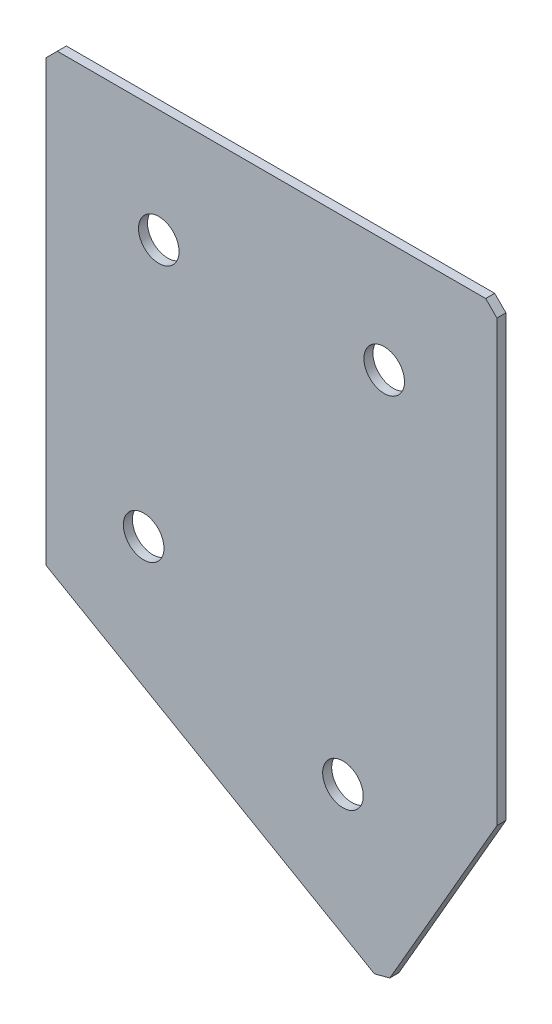
ISO-10303-21;
HEADER;
FILE_DESCRIPTION(('STEP AP214'),'2;1');
FILE_NAME('part.step','',(''),(''),'','','');
FILE_SCHEMA(('AUTOMOTIVE_DESIGN { 1 0 10303 214 1 1 1 1 }'));
ENDSEC;
DATA;
#1=APPLICATION_CONTEXT('core data for automotive mechanical design processes');
#2=APPLICATION_PROTOCOL_DEFINITION('international standard','automotive_design',2000,#1);
#3=PRODUCT_CONTEXT('',#1,'mechanical');
#4=PRODUCT('Part','Part','',(#3));
#5=PRODUCT_RELATED_PRODUCT_CATEGORY('part','',(#4));
#6=PRODUCT_DEFINITION_FORMATION('','',#4);
#7=PRODUCT_DEFINITION_CONTEXT('part definition',#1,'design');
#8=PRODUCT_DEFINITION('design','',#6,#7);
#9=PRODUCT_DEFINITION_SHAPE('','',#8);
#10=(LENGTH_UNIT() NAMED_UNIT(*) SI_UNIT(.MILLI.,.METRE.));
#11=(NAMED_UNIT(*) PLANE_ANGLE_UNIT() SI_UNIT($,.RADIAN.));
#12=(NAMED_UNIT(*) SI_UNIT($,.STERADIAN.) SOLID_ANGLE_UNIT());
#13=UNCERTAINTY_MEASURE_WITH_UNIT(LENGTH_MEASURE(1.E-05),#10,'distance_accuracy_value','');
#14=(GEOMETRIC_REPRESENTATION_CONTEXT(3) GLOBAL_UNCERTAINTY_ASSIGNED_CONTEXT((#13)) GLOBAL_UNIT_ASSIGNED_CONTEXT((#10,
#11,#12)) REPRESENTATION_CONTEXT('',''));
#15=CARTESIAN_POINT('',(0.,0.,0.));
#16=DIRECTION('',(0.,0.,1.));
#17=DIRECTION('',(1.,0.,0.));
#18=AXIS2_PLACEMENT_3D('',#15,#16,#17);
#19=CARTESIAN_POINT('',(0.,0.,-2.));
#20=DIRECTION('',(1.,0.,0.));
#21=DIRECTION('',(0.,0.,-1.));
#22=AXIS2_PLACEMENT_3D('',#19,#20,#21);
#23=PLANE('',#22);
#24=DIRECTION('',(0.,1.,0.));
#25=VECTOR('',#24,1.);
#26=CARTESIAN_POINT('',(0.,0.,0.));
#27=LINE('',#26,#25);
#28=CARTESIAN_POINT('',(0.,-100.,0.));
#29=VERTEX_POINT('',#28);
#30=CARTESIAN_POINT('',(0.,-2.49999999999999,0.));
#31=VERTEX_POINT('',#30);
#32=EDGE_CURVE('E137',#29,#31,#27,.T.);
#33=ORIENTED_EDGE('',*,*,#32,.T.);
#34=DIRECTION('',(0.,0.,-1.));
#35=VECTOR('',#34,1.);
#36=CARTESIAN_POINT('',(0.,-2.49999999999999,-2.));
#37=LINE('',#36,#35);
#38=CARTESIAN_POINT('',(0.,-2.49999999999999,-2.));
#39=VERTEX_POINT('',#38);
#40=EDGE_CURVE('E11',#31,#39,#37,.T.);
#41=ORIENTED_EDGE('',*,*,#40,.T.);
#42=DIRECTION('',(0.,1.,0.));
#43=VECTOR('',#42,1.);
#44=CARTESIAN_POINT('',(0.,0.,-2.));
#45=LINE('',#44,#43);
#46=CARTESIAN_POINT('',(0.,-100.,-2.));
#47=VERTEX_POINT('',#46);
#48=EDGE_CURVE('E153',#47,#39,#45,.T.);
#49=ORIENTED_EDGE('',*,*,#48,.F.);
#50=DIRECTION('',(0.,0.,1.));
#51=VECTOR('',#50,1.);
#52=CARTESIAN_POINT('',(0.,-100.,-2.));
#53=LINE('',#52,#51);
#54=EDGE_CURVE('E125',#47,#29,#53,.T.);
#55=ORIENTED_EDGE('',*,*,#54,.T.);
#56=EDGE_LOOP('',(#33,#41,#49,#55));
#57=FACE_BOUND('',#56,.T.);
#58=ADVANCED_FACE('F39',(#57),#23,.F.);
#59=CARTESIAN_POINT('',(0.,0.,-2.));
#60=DIRECTION('',(0.,-1.,0.));
#61=DIRECTION('',(0.,0.,-1.));
#62=AXIS2_PLACEMENT_3D('',#59,#60,#61);
#63=PLANE('',#62);
#64=DIRECTION('',(1.,0.,0.));
#65=VECTOR('',#64,1.);
#66=CARTESIAN_POINT('',(0.,0.,0.));
#67=LINE('',#66,#65);
#68=CARTESIAN_POINT('',(2.49999999999999,0.,0.));
#69=VERTEX_POINT('',#68);
#70=CARTESIAN_POINT('',(97.5,0.,0.));
#71=VERTEX_POINT('',#70);
#72=EDGE_CURVE('E141',#69,#71,#67,.T.);
#73=ORIENTED_EDGE('',*,*,#72,.T.);
#74=DIRECTION('',(0.,0.,-1.));
#75=VECTOR('',#74,1.);
#76=CARTESIAN_POINT('',(97.5,0.,-2.));
#77=LINE('',#76,#75);
#78=CARTESIAN_POINT('',(97.5,0.,-2.));
#79=VERTEX_POINT('',#78);
#80=EDGE_CURVE('E48',#71,#79,#77,.T.);
#81=ORIENTED_EDGE('',*,*,#80,.T.);
#82=DIRECTION('',(1.,0.,0.));
#83=VECTOR('',#82,1.);
#84=CARTESIAN_POINT('',(0.,0.,-2.));
#85=LINE('',#84,#83);
#86=CARTESIAN_POINT('',(2.49999999999999,0.,-2.));
#87=VERTEX_POINT('',#86);
#88=EDGE_CURVE('E113',#87,#79,#85,.T.);
#89=ORIENTED_EDGE('',*,*,#88,.F.);
#90=DIRECTION('',(0.,0.,1.));
#91=VECTOR('',#90,1.);
#92=CARTESIAN_POINT('',(2.49999999999999,0.,-2.));
#93=LINE('',#92,#91);
#94=EDGE_CURVE('E182',#87,#69,#93,.T.);
#95=ORIENTED_EDGE('',*,*,#94,.T.);
#96=EDGE_LOOP('',(#73,#81,#89,#95));
#97=FACE_BOUND('',#96,.T.);
#98=ADVANCED_FACE('F188',(#97),#63,.F.);
#99=CARTESIAN_POINT('',(100.,0.,-2.));
#100=DIRECTION('',(-1.,0.,0.));
#101=DIRECTION('',(0.,0.,1.));
#102=AXIS2_PLACEMENT_3D('',#99,#100,#101);
#103=PLANE('',#102);
#104=DIRECTION('',(0.,-1.,0.));
#105=VECTOR('',#104,1.);
#106=CARTESIAN_POINT('',(100.,0.,-2.));
#107=LINE('',#106,#105);
#108=CARTESIAN_POINT('',(100.,-2.50000000000004,-2.));
#109=VERTEX_POINT('',#108);
#110=CARTESIAN_POINT('',(100.,-100.,-2.));
#111=VERTEX_POINT('',#110);
#112=EDGE_CURVE('E103',#109,#111,#107,.T.);
#113=ORIENTED_EDGE('',*,*,#112,.F.);
#114=DIRECTION('',(0.,0.,1.));
#115=VECTOR('',#114,1.);
#116=CARTESIAN_POINT('',(100.,-2.50000000000004,-2.));
#117=LINE('',#116,#115);
#118=CARTESIAN_POINT('',(100.,-2.50000000000004,0.));
#119=VERTEX_POINT('',#118);
#120=EDGE_CURVE('E179',#109,#119,#117,.T.);
#121=ORIENTED_EDGE('',*,*,#120,.T.);
#122=DIRECTION('',(0.,-1.,0.));
#123=VECTOR('',#122,1.);
#124=CARTESIAN_POINT('',(100.,0.,0.));
#125=LINE('',#124,#123);
#126=CARTESIAN_POINT('',(100.,-100.,0.));
#127=VERTEX_POINT('',#126);
#128=EDGE_CURVE('E119',#119,#127,#125,.T.);
#129=ORIENTED_EDGE('',*,*,#128,.T.);
#130=DIRECTION('',(0.,0.,1.));
#131=VECTOR('',#130,1.);
#132=CARTESIAN_POINT('',(100.,-100.,-2.));
#133=LINE('',#132,#131);
#134=EDGE_CURVE('E116',#111,#127,#133,.T.);
#135=ORIENTED_EDGE('',*,*,#134,.F.);
#136=EDGE_LOOP('',(#113,#121,#129,#135));
#137=FACE_BOUND('',#136,.T.);
#138=ADVANCED_FACE('F117',(#137),#103,.F.);
#139=CARTESIAN_POINT('',(75.,-143.301270189222,-2.));
#140=DIRECTION('',(-0.866025403784438,0.500000000000001,0.));
#141=DIRECTION('',(-0.500000000000001,-0.866025403784438,0.));
#142=AXIS2_PLACEMENT_3D('',#139,#140,#141);
#143=PLANE('',#142);
#144=DIRECTION('',(-0.500000000000001,-0.866025403784438,0.));
#145=VECTOR('',#144,1.);
#146=CARTESIAN_POINT('',(75.,-143.301270189222,0.));
#147=LINE('',#146,#145);
#148=CARTESIAN_POINT('',(76.25,-141.136206679761,0.));
#149=VERTEX_POINT('',#148);
#150=EDGE_CURVE('E147',#127,#149,#147,.T.);
#151=ORIENTED_EDGE('',*,*,#150,.T.);
#152=DIRECTION('',(0.,0.,-1.));
#153=VECTOR('',#152,1.);
#154=CARTESIAN_POINT('',(76.25,-141.136206679761,-2.));
#155=LINE('',#154,#153);
#156=CARTESIAN_POINT('',(76.25,-141.136206679761,-2.));
#157=VERTEX_POINT('',#156);
#158=EDGE_CURVE('E129',#149,#157,#155,.T.);
#159=ORIENTED_EDGE('',*,*,#158,.T.);
#160=DIRECTION('',(-0.500000000000001,-0.866025403784438,0.));
#161=VECTOR('',#160,1.);
#162=CARTESIAN_POINT('',(75.,-143.301270189222,-2.));
#163=LINE('',#162,#161);
#164=EDGE_CURVE('E107',#111,#157,#163,.T.);
#165=ORIENTED_EDGE('',*,*,#164,.F.);
#166=ORIENTED_EDGE('',*,*,#134,.T.);
#167=EDGE_LOOP('',(#151,#159,#165,#166));
#168=FACE_BOUND('',#167,.T.);
#169=ADVANCED_FACE('F127',(#168),#143,.F.);
#170=CARTESIAN_POINT('',(0.,-100.,-2.));
#171=DIRECTION('',(0.500000000000001,0.866025403784438,0.));
#172=DIRECTION('',(-0.866025403784438,0.500000000000001,0.));
#173=AXIS2_PLACEMENT_3D('',#170,#171,#172);
#174=PLANE('',#173);
#175=DIRECTION('',(-0.866025403784438,0.500000000000001,0.));
#176=VECTOR('',#175,1.);
#177=CARTESIAN_POINT('',(0.,-100.,-2.));
#178=LINE('',#177,#176);
#179=CARTESIAN_POINT('',(72.8349364905389,-142.051270189222,-2.));
#180=VERTEX_POINT('',#179);
#181=EDGE_CURVE('E131',#180,#47,#178,.T.);
#182=ORIENTED_EDGE('',*,*,#181,.F.);
#183=DIRECTION('',(0.,0.,1.));
#184=VECTOR('',#183,1.);
#185=CARTESIAN_POINT('',(72.8349364905389,-142.051270189222,-2.));
#186=LINE('',#185,#184);
#187=CARTESIAN_POINT('',(72.8349364905389,-142.051270189222,0.));
#188=VERTEX_POINT('',#187);
#189=EDGE_CURVE('E124',#180,#188,#186,.T.);
#190=ORIENTED_EDGE('',*,*,#189,.T.);
#191=DIRECTION('',(-0.866025403784438,0.500000000000001,0.));
#192=VECTOR('',#191,1.);
#193=CARTESIAN_POINT('',(0.,-100.,0.));
#194=LINE('',#193,#192);
#195=EDGE_CURVE('E150',#188,#29,#194,.T.);
#196=ORIENTED_EDGE('',*,*,#195,.T.);
#197=ORIENTED_EDGE('',*,*,#54,.F.);
#198=EDGE_LOOP('',(#182,#190,#196,#197));
#199=FACE_BOUND('',#198,.T.);
#200=ADVANCED_FACE('F218',(#199),#174,.F.);
#201=CARTESIAN_POINT('',(0.,0.,-2.));
#202=DIRECTION('',(0.,0.,1.));
#203=DIRECTION('',(1.,0.,0.));
#204=AXIS2_PLACEMENT_3D('',#201,#202,#203);
#205=PLANE('',#204);
#206=CARTESIAN_POINT('',(25.,-25.,-2.));
#207=DIRECTION('',(0.,0.,-1.));
#208=DIRECTION('',(0.,1.,0.));
#209=AXIS2_PLACEMENT_3D('',#206,#207,#208);
#210=CIRCLE('',#209,4.5);
#211=CARTESIAN_POINT('',(25.,-20.5,-2.));
#212=VERTEX_POINT('',#211);
#213=EDGE_CURVE('E250',#212,#212,#210,.T.);
#214=ORIENTED_EDGE('',*,*,#213,.F.);
#215=EDGE_LOOP('',(#214));
#216=FACE_BOUND('',#215,.T.);
#217=CARTESIAN_POINT('',(75.,-25.,-2.));
#218=DIRECTION('',(0.,0.,-1.));
#219=DIRECTION('',(0.,1.,0.));
#220=AXIS2_PLACEMENT_3D('',#217,#218,#219);
#221=CIRCLE('',#220,4.5);
#222=CARTESIAN_POINT('',(75.,-20.5,-2.));
#223=VERTEX_POINT('',#222);
#224=EDGE_CURVE('E254',#223,#223,#221,.T.);
#225=ORIENTED_EDGE('',*,*,#224,.F.);
#226=EDGE_LOOP('',(#225));
#227=FACE_BOUND('',#226,.T.);
#228=CARTESIAN_POINT('',(21.650635094611,-83.6324865405189,-2.00000000000001));
#229=DIRECTION('',(0.,0.,-1.));
#230=DIRECTION('',(0.,1.,0.));
#231=AXIS2_PLACEMENT_3D('',#228,#229,#230);
#232=CIRCLE('',#231,4.5);
#233=CARTESIAN_POINT('',(21.650635094611,-79.1324865405189,-2.));
#234=VERTEX_POINT('',#233);
#235=EDGE_CURVE('E264',#234,#234,#232,.T.);
#236=ORIENTED_EDGE('',*,*,#235,.F.);
#237=EDGE_LOOP('',(#236));
#238=FACE_BOUND('',#237,.T.);
#239=CARTESIAN_POINT('',(65.8493649053891,-109.150635094611,-2.00000000000001));
#240=DIRECTION('',(0.,0.,-1.));
#241=DIRECTION('',(0.,1.,0.));
#242=AXIS2_PLACEMENT_3D('',#239,#240,#241);
#243=CIRCLE('',#242,4.5);
#244=CARTESIAN_POINT('',(65.8493649053891,-104.650635094611,-2.00000000000001));
#245=VERTEX_POINT('',#244);
#246=EDGE_CURVE('E272',#245,#245,#243,.T.);
#247=ORIENTED_EDGE('',*,*,#246,.F.);
#248=EDGE_LOOP('',(#247));
#249=FACE_BOUND('',#248,.T.);
#250=ORIENTED_EDGE('',*,*,#164,.T.);
#251=DIRECTION('',(0.965925826289068,0.258819045102523,0.));
#252=VECTOR('',#251,1.);
#253=CARTESIAN_POINT('',(72.8349364905389,-142.051270189222,-2.));
#254=LINE('',#253,#252);
#255=EDGE_CURVE('E176',#157,#180,#254,.F.);
#256=ORIENTED_EDGE('',*,*,#255,.T.);
#257=ORIENTED_EDGE('',*,*,#181,.T.);
#258=ORIENTED_EDGE('',*,*,#48,.T.);
#259=DIRECTION('',(-0.707106781186548,-0.707106781186548,0.));
#260=VECTOR('',#259,1.);
#261=CARTESIAN_POINT('',(2.49999999999999,0.,-2.));
#262=LINE('',#261,#260);
#263=EDGE_CURVE('E171',#39,#87,#262,.F.);
#264=ORIENTED_EDGE('',*,*,#263,.T.);
#265=ORIENTED_EDGE('',*,*,#88,.T.);
#266=DIRECTION('',(-0.707106781186546,0.70710678118655,0.));
#267=VECTOR('',#266,1.);
#268=CARTESIAN_POINT('',(100.,-2.50000000000004,-2.));
#269=LINE('',#268,#267);
#270=EDGE_CURVE('E55',#79,#109,#269,.F.);
#271=ORIENTED_EDGE('',*,*,#270,.T.);
#272=ORIENTED_EDGE('',*,*,#112,.T.);
#273=EDGE_LOOP('',(#250,#256,#257,#258,#264,#265,#271,#272));
#274=FACE_BOUND('',#273,.T.);
#275=ADVANCED_FACE('F105',(#216,#227,#238,#249,#274),#205,.F.);
#276=CARTESIAN_POINT('',(0.,0.,0.));
#277=DIRECTION('',(0.,0.,1.));
#278=DIRECTION('',(1.,0.,0.));
#279=AXIS2_PLACEMENT_3D('',#276,#277,#278);
#280=PLANE('',#279);
#281=CARTESIAN_POINT('',(25.,-25.,0.));
#282=DIRECTION('',(0.,0.,-1.));
#283=DIRECTION('',(0.,1.,0.));
#284=AXIS2_PLACEMENT_3D('',#281,#282,#283);
#285=CIRCLE('',#284,4.5);
#286=CARTESIAN_POINT('',(25.,-20.5,0.));
#287=VERTEX_POINT('',#286);
#288=EDGE_CURVE('E247',#287,#287,#285,.T.);
#289=ORIENTED_EDGE('',*,*,#288,.T.);
#290=EDGE_LOOP('',(#289));
#291=FACE_BOUND('',#290,.T.);
#292=CARTESIAN_POINT('',(75.,-25.,0.));
#293=DIRECTION('',(0.,0.,-1.));
#294=DIRECTION('',(0.,1.,0.));
#295=AXIS2_PLACEMENT_3D('',#292,#293,#294);
#296=CIRCLE('',#295,4.5);
#297=CARTESIAN_POINT('',(75.,-20.5,0.));
#298=VERTEX_POINT('',#297);
#299=EDGE_CURVE('E260',#298,#298,#296,.T.);
#300=ORIENTED_EDGE('',*,*,#299,.T.);
#301=EDGE_LOOP('',(#300));
#302=FACE_BOUND('',#301,.T.);
#303=CARTESIAN_POINT('',(21.650635094611,-83.6324865405189,0.));
#304=DIRECTION('',(0.,0.,-1.));
#305=DIRECTION('',(0.,1.,0.));
#306=AXIS2_PLACEMENT_3D('',#303,#304,#305);
#307=CIRCLE('',#306,4.5);
#308=CARTESIAN_POINT('',(21.650635094611,-79.1324865405189,0.));
#309=VERTEX_POINT('',#308);
#310=EDGE_CURVE('E268',#309,#309,#307,.T.);
#311=ORIENTED_EDGE('',*,*,#310,.T.);
#312=EDGE_LOOP('',(#311));
#313=FACE_BOUND('',#312,.T.);
#314=CARTESIAN_POINT('',(65.8493649053891,-109.150635094611,0.));
#315=DIRECTION('',(0.,0.,-1.));
#316=DIRECTION('',(0.,1.,0.));
#317=AXIS2_PLACEMENT_3D('',#314,#315,#316);
#318=CIRCLE('',#317,4.5);
#319=CARTESIAN_POINT('',(65.8493649053891,-104.650635094611,0.));
#320=VERTEX_POINT('',#319);
#321=EDGE_CURVE('E142',#320,#320,#318,.T.);
#322=ORIENTED_EDGE('',*,*,#321,.T.);
#323=EDGE_LOOP('',(#322));
#324=FACE_BOUND('',#323,.T.);
#325=ORIENTED_EDGE('',*,*,#195,.F.);
#326=DIRECTION('',(-0.965925826289068,-0.258819045102523,0.));
#327=VECTOR('',#326,1.);
#328=CARTESIAN_POINT('',(40.3918331506589,-150.744373529102,0.));
#329=LINE('',#328,#327);
#330=EDGE_CURVE('E166',#188,#149,#329,.F.);
#331=ORIENTED_EDGE('',*,*,#330,.T.);
#332=ORIENTED_EDGE('',*,*,#150,.F.);
#333=ORIENTED_EDGE('',*,*,#128,.F.);
#334=DIRECTION('',(0.707106781186546,-0.70710678118655,0.));
#335=VECTOR('',#334,1.);
#336=CARTESIAN_POINT('',(48.7500000000003,48.75,0.));
#337=LINE('',#336,#335);
#338=EDGE_CURVE('E163',#119,#71,#337,.F.);
#339=ORIENTED_EDGE('',*,*,#338,.T.);
#340=ORIENTED_EDGE('',*,*,#72,.F.);
#341=DIRECTION('',(0.707106781186548,0.707106781186548,0.));
#342=VECTOR('',#341,1.);
#343=CARTESIAN_POINT('',(1.24999999999999,-1.24999999999999,0.));
#344=LINE('',#343,#342);
#345=EDGE_CURVE('E160',#69,#31,#344,.F.);
#346=ORIENTED_EDGE('',*,*,#345,.T.);
#347=ORIENTED_EDGE('',*,*,#32,.F.);
#348=EDGE_LOOP('',(#325,#331,#332,#333,#339,#340,#346,#347));
#349=FACE_BOUND('',#348,.T.);
#350=ADVANCED_FACE('F193',(#291,#302,#313,#324,#349),#280,.T.);
#351=CARTESIAN_POINT('',(65.8493649053891,-109.150635094611,-2.00000000000001));
#352=DIRECTION('',(0.,0.,-1.));
#353=DIRECTION('',(0.,1.,0.));
#354=AXIS2_PLACEMENT_3D('',#351,#352,#353);
#355=CYLINDRICAL_SURFACE('',#354,4.5);
#356=ORIENTED_EDGE('',*,*,#321,.F.);
#357=EDGE_LOOP('',(#356));
#358=FACE_BOUND('',#357,.T.);
#359=ORIENTED_EDGE('',*,*,#246,.T.);
#360=EDGE_LOOP('',(#359));
#361=FACE_BOUND('',#360,.T.);
#362=ADVANCED_FACE('F224',(#358,#361),#355,.F.);
#363=CARTESIAN_POINT('',(21.650635094611,-83.6324865405189,-2.00000000000001));
#364=DIRECTION('',(0.,0.,-1.));
#365=DIRECTION('',(0.,1.,0.));
#366=AXIS2_PLACEMENT_3D('',#363,#364,#365);
#367=CYLINDRICAL_SURFACE('',#366,4.5);
#368=ORIENTED_EDGE('',*,*,#310,.F.);
#369=EDGE_LOOP('',(#368));
#370=FACE_BOUND('',#369,.T.);
#371=ORIENTED_EDGE('',*,*,#235,.T.);
#372=EDGE_LOOP('',(#371));
#373=FACE_BOUND('',#372,.T.);
#374=ADVANCED_FACE('F231',(#370,#373),#367,.F.);
#375=CARTESIAN_POINT('',(75.,-25.,-2.));
#376=DIRECTION('',(0.,0.,-1.));
#377=DIRECTION('',(0.,1.,0.));
#378=AXIS2_PLACEMENT_3D('',#375,#376,#377);
#379=CYLINDRICAL_SURFACE('',#378,4.5);
#380=ORIENTED_EDGE('',*,*,#299,.F.);
#381=EDGE_LOOP('',(#380));
#382=FACE_BOUND('',#381,.T.);
#383=ORIENTED_EDGE('',*,*,#224,.T.);
#384=EDGE_LOOP('',(#383));
#385=FACE_BOUND('',#384,.T.);
#386=ADVANCED_FACE('F235',(#382,#385),#379,.F.);
#387=CARTESIAN_POINT('',(25.,-25.,-2.));
#388=DIRECTION('',(0.,0.,-1.));
#389=DIRECTION('',(0.,1.,0.));
#390=AXIS2_PLACEMENT_3D('',#387,#388,#389);
#391=CYLINDRICAL_SURFACE('',#390,4.5);
#392=ORIENTED_EDGE('',*,*,#288,.F.);
#393=EDGE_LOOP('',(#392));
#394=FACE_BOUND('',#393,.T.);
#395=ORIENTED_EDGE('',*,*,#213,.T.);
#396=EDGE_LOOP('',(#395));
#397=FACE_BOUND('',#396,.T.);
#398=ADVANCED_FACE('F203',(#394,#397),#391,.F.);
#399=CARTESIAN_POINT('',(72.8349364905389,-142.051270189222,-2.));
#400=DIRECTION('',(-0.258819045102523,0.965925826289068,0.));
#401=DIRECTION('',(0.,0.,1.));
#402=AXIS2_PLACEMENT_3D('',#399,#400,#401);
#403=PLANE('',#402);
#404=ORIENTED_EDGE('',*,*,#255,.F.);
#405=ORIENTED_EDGE('',*,*,#158,.F.);
#406=ORIENTED_EDGE('',*,*,#330,.F.);
#407=ORIENTED_EDGE('',*,*,#189,.F.);
#408=EDGE_LOOP('',(#404,#405,#406,#407));
#409=FACE_BOUND('',#408,.T.);
#410=ADVANCED_FACE('F198',(#409),#403,.F.);
#411=CARTESIAN_POINT('',(100.,-2.50000000000004,-2.));
#412=DIRECTION('',(-0.707106781186549,-0.707106781186545,0.));
#413=DIRECTION('',(0.,0.,1.));
#414=AXIS2_PLACEMENT_3D('',#411,#412,#413);
#415=PLANE('',#414);
#416=ORIENTED_EDGE('',*,*,#270,.F.);
#417=ORIENTED_EDGE('',*,*,#80,.F.);
#418=ORIENTED_EDGE('',*,*,#338,.F.);
#419=ORIENTED_EDGE('',*,*,#120,.F.);
#420=EDGE_LOOP('',(#416,#417,#418,#419));
#421=FACE_BOUND('',#420,.T.);
#422=ADVANCED_FACE('F196',(#421),#415,.F.);
#423=CARTESIAN_POINT('',(2.49999999999999,0.,-2.));
#424=DIRECTION('',(0.707106781186548,-0.707106781186548,0.));
#425=DIRECTION('',(0.,0.,1.));
#426=AXIS2_PLACEMENT_3D('',#423,#424,#425);
#427=PLANE('',#426);
#428=ORIENTED_EDGE('',*,*,#263,.F.);
#429=ORIENTED_EDGE('',*,*,#40,.F.);
#430=ORIENTED_EDGE('',*,*,#345,.F.);
#431=ORIENTED_EDGE('',*,*,#94,.F.);
#432=EDGE_LOOP('',(#428,#429,#430,#431));
#433=FACE_BOUND('',#432,.T.);
#434=ADVANCED_FACE('F41',(#433),#427,.F.);
#435=CLOSED_SHELL('',(#58,#98,#138,#169,#200,#275,#350,#362,#374,#386,#398,#410,#422,#434));
#436=MANIFOLD_SOLID_BREP('B2',#435);
#437=ADVANCED_BREP_SHAPE_REPRESENTATION('',(#18,#436),#14);
#438=SHAPE_DEFINITION_REPRESENTATION(#9,#437);
ENDSEC;
END-ISO-10303-21;
